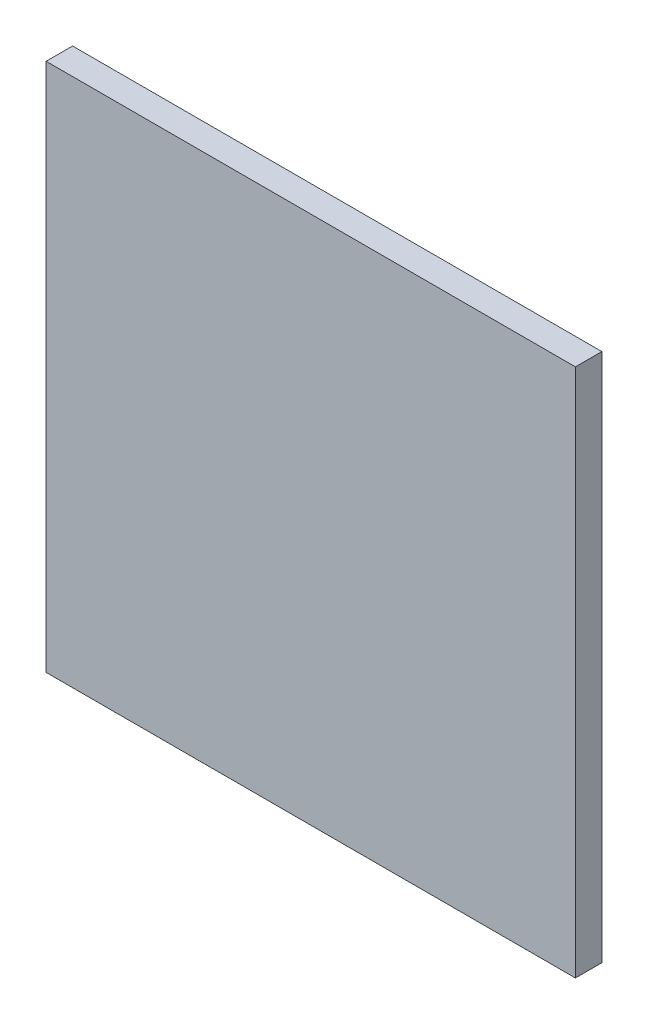
ISO-10303-21;
HEADER;
FILE_DESCRIPTION(('STEP AP214'),'2;1');
FILE_NAME('part.step','',(''),(''),'','','');
FILE_SCHEMA(('AUTOMOTIVE_DESIGN { 1 0 10303 214 1 1 1 1 }'));
ENDSEC;
DATA;
#1=APPLICATION_CONTEXT('core data for automotive mechanical design processes');
#2=APPLICATION_PROTOCOL_DEFINITION('international standard','automotive_design',2000,#1);
#3=PRODUCT_CONTEXT('',#1,'mechanical');
#4=PRODUCT('Part','Part','',(#3));
#5=PRODUCT_RELATED_PRODUCT_CATEGORY('part','',(#4));
#6=PRODUCT_DEFINITION_FORMATION('','',#4);
#7=PRODUCT_DEFINITION_CONTEXT('part definition',#1,'design');
#8=PRODUCT_DEFINITION('design','',#6,#7);
#9=PRODUCT_DEFINITION_SHAPE('','',#8);
#10=(LENGTH_UNIT() NAMED_UNIT(*) SI_UNIT(.MILLI.,.METRE.));
#11=(NAMED_UNIT(*) PLANE_ANGLE_UNIT() SI_UNIT($,.RADIAN.));
#12=(NAMED_UNIT(*) SI_UNIT($,.STERADIAN.) SOLID_ANGLE_UNIT());
#13=UNCERTAINTY_MEASURE_WITH_UNIT(LENGTH_MEASURE(1.E-05),#10,'distance_accuracy_value','');
#14=(GEOMETRIC_REPRESENTATION_CONTEXT(3) GLOBAL_UNCERTAINTY_ASSIGNED_CONTEXT((#13)) GLOBAL_UNIT_ASSIGNED_CONTEXT((#10,
#11,#12)) REPRESENTATION_CONTEXT('',''));
#15=CARTESIAN_POINT('',(0.,0.,0.));
#16=DIRECTION('',(0.,0.,1.));
#17=DIRECTION('',(1.,0.,0.));
#18=AXIS2_PLACEMENT_3D('',#15,#16,#17);
#19=CARTESIAN_POINT('',(0.,0.,6.35));
#20=DIRECTION('',(0.,1.,0.));
#21=DIRECTION('',(0.,0.,1.));
#22=AXIS2_PLACEMENT_3D('',#19,#20,#21);
#23=PLANE('',#22);
#24=DIRECTION('',(1.,0.,0.));
#25=VECTOR('',#24,1.);
#26=CARTESIAN_POINT('',(0.,0.,0.));
#27=LINE('',#26,#25);
#28=CARTESIAN_POINT('',(-127.,0.,0.));
#29=VERTEX_POINT('',#28);
#30=CARTESIAN_POINT('',(0.,0.,0.));
#31=VERTEX_POINT('',#30);
#32=EDGE_CURVE('E113',#29,#31,#27,.T.);
#33=ORIENTED_EDGE('',*,*,#32,.T.);
#34=DIRECTION('',(0.,0.,-1.));
#35=VECTOR('',#34,1.);
#36=CARTESIAN_POINT('',(0.,0.,6.35));
#37=LINE('',#36,#35);
#38=CARTESIAN_POINT('',(0.,0.,6.35));
#39=VERTEX_POINT('',#38);
#40=EDGE_CURVE('E11',#39,#31,#37,.T.);
#41=ORIENTED_EDGE('',*,*,#40,.F.);
#42=DIRECTION('',(1.,0.,0.));
#43=VECTOR('',#42,1.);
#44=CARTESIAN_POINT('',(0.,0.,6.35));
#45=LINE('',#44,#43);
#46=CARTESIAN_POINT('',(-127.,0.,6.35));
#47=VERTEX_POINT('',#46);
#48=EDGE_CURVE('E97',#47,#39,#45,.T.);
#49=ORIENTED_EDGE('',*,*,#48,.F.);
#50=DIRECTION('',(0.,0.,-1.));
#51=VECTOR('',#50,1.);
#52=CARTESIAN_POINT('',(-127.,0.,6.35));
#53=LINE('',#52,#51);
#54=EDGE_CURVE('E109',#47,#29,#53,.T.);
#55=ORIENTED_EDGE('',*,*,#54,.T.);
#56=EDGE_LOOP('',(#33,#41,#49,#55));
#57=FACE_BOUND('',#56,.T.);
#58=ADVANCED_FACE('F45',(#57),#23,.F.);
#59=CARTESIAN_POINT('',(0.,0.,6.35));
#60=DIRECTION('',(-1.,0.,0.));
#61=DIRECTION('',(0.,0.,1.));
#62=AXIS2_PLACEMENT_3D('',#59,#60,#61);
#63=PLANE('',#62);
#64=DIRECTION('',(0.,1.,0.));
#65=VECTOR('',#64,1.);
#66=CARTESIAN_POINT('',(0.,0.,0.));
#67=LINE('',#66,#65);
#68=CARTESIAN_POINT('',(0.,127.,0.));
#69=VERTEX_POINT('',#68);
#70=EDGE_CURVE('E102',#31,#69,#67,.T.);
#71=ORIENTED_EDGE('',*,*,#70,.T.);
#72=DIRECTION('',(0.,0.,-1.));
#73=VECTOR('',#72,1.);
#74=CARTESIAN_POINT('',(0.,127.,6.35));
#75=LINE('',#74,#73);
#76=CARTESIAN_POINT('',(0.,127.,6.35));
#77=VERTEX_POINT('',#76);
#78=EDGE_CURVE('E54',#77,#69,#75,.T.);
#79=ORIENTED_EDGE('',*,*,#78,.F.);
#80=DIRECTION('',(0.,1.,0.));
#81=VECTOR('',#80,1.);
#82=CARTESIAN_POINT('',(0.,0.,6.35));
#83=LINE('',#82,#81);
#84=EDGE_CURVE('E92',#39,#77,#83,.T.);
#85=ORIENTED_EDGE('',*,*,#84,.F.);
#86=ORIENTED_EDGE('',*,*,#40,.T.);
#87=EDGE_LOOP('',(#71,#79,#85,#86));
#88=FACE_BOUND('',#87,.T.);
#89=ADVANCED_FACE('F101',(#88),#63,.F.);
#90=CARTESIAN_POINT('',(0.,127.,6.35));
#91=DIRECTION('',(0.,-1.,0.));
#92=DIRECTION('',(0.,0.,-1.));
#93=AXIS2_PLACEMENT_3D('',#90,#91,#92);
#94=PLANE('',#93);
#95=DIRECTION('',(-1.,0.,0.));
#96=VECTOR('',#95,1.);
#97=CARTESIAN_POINT('',(0.,127.,0.));
#98=LINE('',#97,#96);
#99=CARTESIAN_POINT('',(-127.,127.,0.));
#100=VERTEX_POINT('',#99);
#101=EDGE_CURVE('E79',#69,#100,#98,.T.);
#102=ORIENTED_EDGE('',*,*,#101,.T.);
#103=DIRECTION('',(0.,0.,-1.));
#104=VECTOR('',#103,1.);
#105=CARTESIAN_POINT('',(-127.,127.,6.35));
#106=LINE('',#105,#104);
#107=CARTESIAN_POINT('',(-127.,127.,6.35));
#108=VERTEX_POINT('',#107);
#109=EDGE_CURVE('E104',#108,#100,#106,.T.);
#110=ORIENTED_EDGE('',*,*,#109,.F.);
#111=DIRECTION('',(-1.,0.,0.));
#112=VECTOR('',#111,1.);
#113=CARTESIAN_POINT('',(0.,127.,6.35));
#114=LINE('',#113,#112);
#115=EDGE_CURVE('E95',#77,#108,#114,.T.);
#116=ORIENTED_EDGE('',*,*,#115,.F.);
#117=ORIENTED_EDGE('',*,*,#78,.T.);
#118=EDGE_LOOP('',(#102,#110,#116,#117));
#119=FACE_BOUND('',#118,.T.);
#120=ADVANCED_FACE('F105',(#119),#94,.F.);
#121=CARTESIAN_POINT('',(-127.,0.,6.35));
#122=DIRECTION('',(1.,0.,0.));
#123=DIRECTION('',(0.,0.,-1.));
#124=AXIS2_PLACEMENT_3D('',#121,#122,#123);
#125=PLANE('',#124);
#126=DIRECTION('',(0.,-1.,0.));
#127=VECTOR('',#126,1.);
#128=CARTESIAN_POINT('',(-127.,0.,0.));
#129=LINE('',#128,#127);
#130=EDGE_CURVE('E85',#100,#29,#129,.T.);
#131=ORIENTED_EDGE('',*,*,#130,.T.);
#132=ORIENTED_EDGE('',*,*,#54,.F.);
#133=DIRECTION('',(0.,-1.,0.));
#134=VECTOR('',#133,1.);
#135=CARTESIAN_POINT('',(-127.,0.,6.35));
#136=LINE('',#135,#134);
#137=EDGE_CURVE('E62',#108,#47,#136,.T.);
#138=ORIENTED_EDGE('',*,*,#137,.F.);
#139=ORIENTED_EDGE('',*,*,#109,.T.);
#140=EDGE_LOOP('',(#131,#132,#138,#139));
#141=FACE_BOUND('',#140,.T.);
#142=ADVANCED_FACE('F126',(#141),#125,.F.);
#143=CARTESIAN_POINT('',(0.,0.,6.35));
#144=DIRECTION('',(0.,0.,-1.));
#145=DIRECTION('',(-1.,0.,0.));
#146=AXIS2_PLACEMENT_3D('',#143,#144,#145);
#147=PLANE('',#146);
#148=ORIENTED_EDGE('',*,*,#48,.T.);
#149=ORIENTED_EDGE('',*,*,#84,.T.);
#150=ORIENTED_EDGE('',*,*,#115,.T.);
#151=ORIENTED_EDGE('',*,*,#137,.T.);
#152=EDGE_LOOP('',(#148,#149,#150,#151));
#153=FACE_BOUND('',#152,.T.);
#154=ADVANCED_FACE('F93',(#153),#147,.F.);
#155=CARTESIAN_POINT('',(0.,0.,0.));
#156=DIRECTION('',(0.,0.,-1.));
#157=DIRECTION('',(-1.,0.,0.));
#158=AXIS2_PLACEMENT_3D('',#155,#156,#157);
#159=PLANE('',#158);
#160=ORIENTED_EDGE('',*,*,#32,.F.);
#161=ORIENTED_EDGE('',*,*,#130,.F.);
#162=ORIENTED_EDGE('',*,*,#101,.F.);
#163=ORIENTED_EDGE('',*,*,#70,.F.);
#164=EDGE_LOOP('',(#160,#161,#162,#163));
#165=FACE_BOUND('',#164,.T.);
#166=ADVANCED_FACE('F129',(#165),#159,.T.);
#167=CLOSED_SHELL('',(#58,#89,#120,#142,#154,#166));
#168=MANIFOLD_SOLID_BREP('B2',#167);
#169=ADVANCED_BREP_SHAPE_REPRESENTATION('',(#18,#168),#14);
#170=SHAPE_DEFINITION_REPRESENTATION(#9,#169);
ENDSEC;
END-ISO-10303-21;
